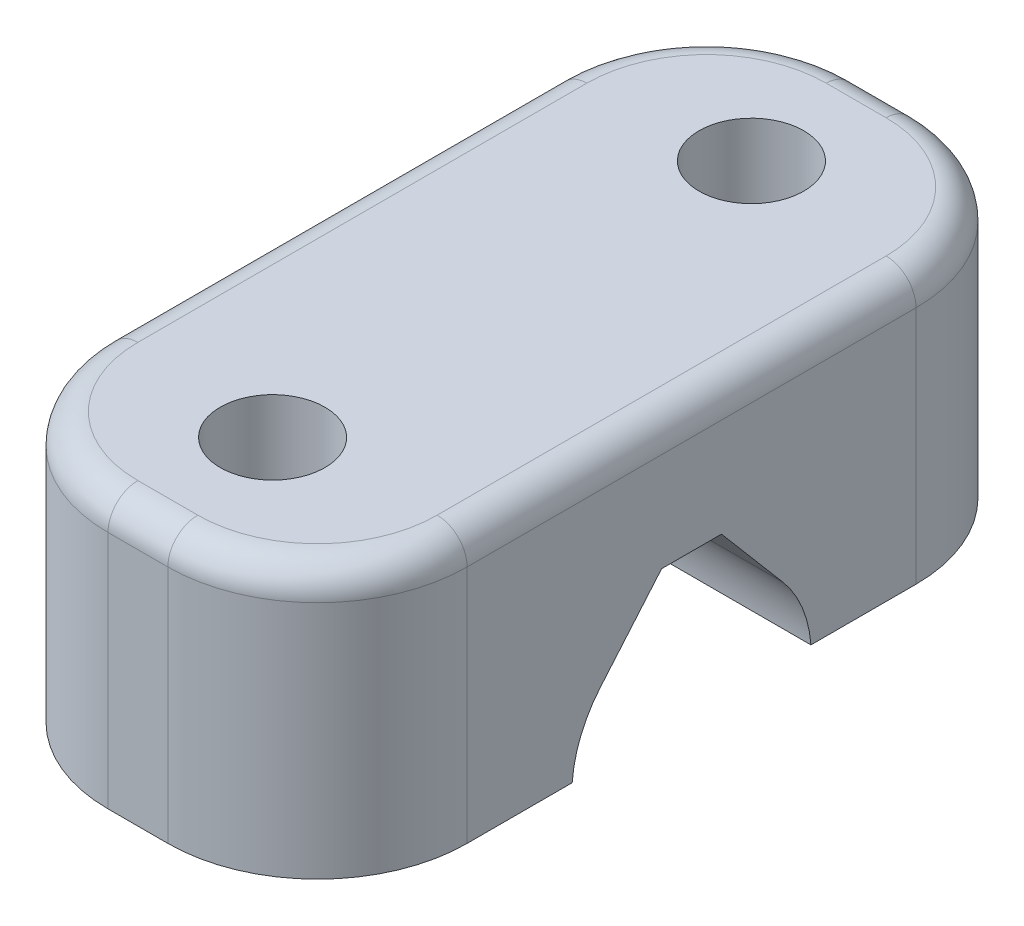
ISO-10303-21;
HEADER;
FILE_DESCRIPTION(('STEP AP214'),'2;1');
FILE_NAME('part.step','',(''),(''),'','','');
FILE_SCHEMA(('AUTOMOTIVE_DESIGN { 1 0 10303 214 1 1 1 1 }'));
ENDSEC;
DATA;
#1=APPLICATION_CONTEXT('core data for automotive mechanical design processes');
#2=APPLICATION_PROTOCOL_DEFINITION('international standard','automotive_design',2000,#1);
#3=PRODUCT_CONTEXT('',#1,'mechanical');
#4=PRODUCT('Part','Part','',(#3));
#5=PRODUCT_RELATED_PRODUCT_CATEGORY('part','',(#4));
#6=PRODUCT_DEFINITION_FORMATION('','',#4);
#7=PRODUCT_DEFINITION_CONTEXT('part definition',#1,'design');
#8=PRODUCT_DEFINITION('design','',#6,#7);
#9=PRODUCT_DEFINITION_SHAPE('','',#8);
#10=(LENGTH_UNIT() NAMED_UNIT(*) SI_UNIT(.MILLI.,.METRE.));
#11=(NAMED_UNIT(*) PLANE_ANGLE_UNIT() SI_UNIT($,.RADIAN.));
#12=(NAMED_UNIT(*) SI_UNIT($,.STERADIAN.) SOLID_ANGLE_UNIT());
#13=UNCERTAINTY_MEASURE_WITH_UNIT(LENGTH_MEASURE(1.E-05),#10,'distance_accuracy_value','');
#14=(GEOMETRIC_REPRESENTATION_CONTEXT(3) GLOBAL_UNCERTAINTY_ASSIGNED_CONTEXT((#13)) GLOBAL_UNIT_ASSIGNED_CONTEXT((#10,
#11,#12)) REPRESENTATION_CONTEXT('',''));
#15=CARTESIAN_POINT('',(0.,0.,0.));
#16=DIRECTION('',(0.,0.,1.));
#17=DIRECTION('',(1.,0.,0.));
#18=AXIS2_PLACEMENT_3D('',#15,#16,#17);
#19=CARTESIAN_POINT('',(0.,9.,-12.5));
#20=DIRECTION('',(1.,0.,0.));
#21=DIRECTION('',(0.,0.,-1.));
#22=AXIS2_PLACEMENT_3D('',#19,#20,#21);
#23=PLANE('',#22);
#24=DIRECTION('',(0.,-1.,0.));
#25=VECTOR('',#24,1.);
#26=CARTESIAN_POINT('',(0.,9.,7.5));
#27=LINE('',#26,#25);
#28=CARTESIAN_POINT('',(0.,0.,7.5));
#29=VERTEX_POINT('',#28);
#30=CARTESIAN_POINT('',(0.,8.,7.5));
#31=VERTEX_POINT('',#30);
#32=EDGE_CURVE('E224',#29,#31,#27,.F.);
#33=ORIENTED_EDGE('',*,*,#32,.T.);
#34=DIRECTION('',(0.,0.,1.));
#35=VECTOR('',#34,1.);
#36=CARTESIAN_POINT('',(0.,8.,-7.5));
#37=LINE('',#36,#35);
#38=CARTESIAN_POINT('',(0.,8.,-7.5));
#39=VERTEX_POINT('',#38);
#40=EDGE_CURVE('E274',#31,#39,#37,.F.);
#41=ORIENTED_EDGE('',*,*,#40,.T.);
#42=DIRECTION('',(0.,-1.,0.));
#43=VECTOR('',#42,1.);
#44=CARTESIAN_POINT('',(0.,9.,-7.5));
#45=LINE('',#44,#43);
#46=CARTESIAN_POINT('',(0.,0.,-7.5));
#47=VERTEX_POINT('',#46);
#48=EDGE_CURVE('E227',#39,#47,#45,.T.);
#49=ORIENTED_EDGE('',*,*,#48,.T.);
#50=DIRECTION('',(0.,0.,1.));
#51=VECTOR('',#50,1.);
#52=CARTESIAN_POINT('',(0.,0.,-12.5));
#53=LINE('',#52,#51);
#54=CARTESIAN_POINT('',(0.,0.,-3.98873413503583));
#55=VERTEX_POINT('',#54);
#56=EDGE_CURVE('E210',#47,#55,#53,.T.);
#57=ORIENTED_EDGE('',*,*,#56,.T.);
#58=CARTESIAN_POINT('',(0.,-0.3,0.));
#59=DIRECTION('',(1.,0.,0.));
#60=DIRECTION('',(0.,0.,-1.));
#61=AXIS2_PLACEMENT_3D('',#58,#59,#60);
#62=CIRCLE('',#61,4.);
#63=CARTESIAN_POINT('',(0.,2.29041882151256,-3.04790589243722));
#64=VERTEX_POINT('',#63);
#65=EDGE_CURVE('E199',#55,#64,#62,.T.);
#66=ORIENTED_EDGE('',*,*,#65,.T.);
#67=DIRECTION('',(0.,0.761976473109303,0.647604705378139));
#68=VECTOR('',#67,1.);
#69=CARTESIAN_POINT('',(0.,4.7,-1.));
#70=LINE('',#69,#68);
#71=CARTESIAN_POINT('',(0.,4.7,-1.));
#72=VERTEX_POINT('',#71);
#73=EDGE_CURVE('E180',#64,#72,#70,.T.);
#74=ORIENTED_EDGE('',*,*,#73,.T.);
#75=DIRECTION('',(0.,0.,1.));
#76=VECTOR('',#75,1.);
#77=CARTESIAN_POINT('',(0.,4.7,0.999999999999999));
#78=LINE('',#77,#76);
#79=CARTESIAN_POINT('',(0.,4.7,0.999999999999999));
#80=VERTEX_POINT('',#79);
#81=EDGE_CURVE('E201',#72,#80,#78,.T.);
#82=ORIENTED_EDGE('',*,*,#81,.T.);
#83=DIRECTION('',(0.,-0.761976473109304,0.647604705378139));
#84=VECTOR('',#83,1.);
#85=CARTESIAN_POINT('',(0.,2.29041882151256,3.04790589243721));
#86=LINE('',#85,#84);
#87=CARTESIAN_POINT('',(0.,2.29041882151256,3.04790589243721));
#88=VERTEX_POINT('',#87);
#89=EDGE_CURVE('E173',#80,#88,#86,.T.);
#90=ORIENTED_EDGE('',*,*,#89,.T.);
#91=CARTESIAN_POINT('',(0.,0.,3.98873413503583));
#92=VERTEX_POINT('',#91);
#93=EDGE_CURVE('E196',#88,#92,#62,.T.);
#94=ORIENTED_EDGE('',*,*,#93,.T.);
#95=EDGE_CURVE('E181',#92,#29,#53,.T.);
#96=ORIENTED_EDGE('',*,*,#95,.T.);
#97=EDGE_LOOP('',(#33,#41,#49,#57,#66,#74,#82,#90,#94,#96));
#98=FACE_BOUND('',#97,.T.);
#99=ADVANCED_FACE('F33',(#98),#23,.F.);
#100=CARTESIAN_POINT('',(12.,9.,-12.5));
#101=DIRECTION('',(-1.,0.,0.));
#102=DIRECTION('',(0.,0.,1.));
#103=AXIS2_PLACEMENT_3D('',#100,#101,#102);
#104=PLANE('',#103);
#105=DIRECTION('',(0.,-1.,0.));
#106=VECTOR('',#105,1.);
#107=CARTESIAN_POINT('',(12.,9.,-7.5));
#108=LINE('',#107,#106);
#109=CARTESIAN_POINT('',(12.,0.,-7.5));
#110=VERTEX_POINT('',#109);
#111=CARTESIAN_POINT('',(12.,8.,-7.5));
#112=VERTEX_POINT('',#111);
#113=EDGE_CURVE('E239',#110,#112,#108,.F.);
#114=ORIENTED_EDGE('',*,*,#113,.T.);
#115=DIRECTION('',(0.,0.,-1.));
#116=VECTOR('',#115,1.);
#117=CARTESIAN_POINT('',(12.,8.,7.5));
#118=LINE('',#117,#116);
#119=CARTESIAN_POINT('',(12.,8.,7.5));
#120=VERTEX_POINT('',#119);
#121=EDGE_CURVE('E11',#112,#120,#118,.F.);
#122=ORIENTED_EDGE('',*,*,#121,.T.);
#123=DIRECTION('',(0.,-1.,0.));
#124=VECTOR('',#123,1.);
#125=CARTESIAN_POINT('',(12.,9.,7.5));
#126=LINE('',#125,#124);
#127=CARTESIAN_POINT('',(12.,0.,7.5));
#128=VERTEX_POINT('',#127);
#129=EDGE_CURVE('E237',#120,#128,#126,.T.);
#130=ORIENTED_EDGE('',*,*,#129,.T.);
#131=DIRECTION('',(0.,0.,-1.));
#132=VECTOR('',#131,1.);
#133=CARTESIAN_POINT('',(12.,0.,-12.5));
#134=LINE('',#133,#132);
#135=CARTESIAN_POINT('',(12.,0.,3.98873413503583));
#136=VERTEX_POINT('',#135);
#137=EDGE_CURVE('E216',#128,#136,#134,.T.);
#138=ORIENTED_EDGE('',*,*,#137,.T.);
#139=CARTESIAN_POINT('',(12.,-0.3,0.));
#140=DIRECTION('',(1.,0.,0.));
#141=DIRECTION('',(0.,0.,-1.));
#142=AXIS2_PLACEMENT_3D('',#139,#140,#141);
#143=CIRCLE('',#142,4.);
#144=CARTESIAN_POINT('',(12.,2.29041882151256,3.04790589243721));
#145=VERTEX_POINT('',#144);
#146=EDGE_CURVE('E172',#145,#136,#143,.T.);
#147=ORIENTED_EDGE('',*,*,#146,.F.);
#148=DIRECTION('',(0.,-0.761976473109304,0.647604705378139));
#149=VECTOR('',#148,1.);
#150=CARTESIAN_POINT('',(12.,2.29041882151256,3.04790589243721));
#151=LINE('',#150,#149);
#152=CARTESIAN_POINT('',(12.,4.7,0.999999999999999));
#153=VERTEX_POINT('',#152);
#154=EDGE_CURVE('E189',#153,#145,#151,.T.);
#155=ORIENTED_EDGE('',*,*,#154,.F.);
#156=DIRECTION('',(0.,0.,1.));
#157=VECTOR('',#156,1.);
#158=CARTESIAN_POINT('',(12.,4.7,0.999999999999999));
#159=LINE('',#158,#157);
#160=CARTESIAN_POINT('',(12.,4.7,-1.));
#161=VERTEX_POINT('',#160);
#162=EDGE_CURVE('E187',#161,#153,#159,.T.);
#163=ORIENTED_EDGE('',*,*,#162,.F.);
#164=DIRECTION('',(0.,0.761976473109303,0.647604705378139));
#165=VECTOR('',#164,1.);
#166=CARTESIAN_POINT('',(12.,4.7,-1.));
#167=LINE('',#166,#165);
#168=CARTESIAN_POINT('',(12.,2.29041882151256,-3.04790589243722));
#169=VERTEX_POINT('',#168);
#170=EDGE_CURVE('E177',#169,#161,#167,.T.);
#171=ORIENTED_EDGE('',*,*,#170,.F.);
#172=CARTESIAN_POINT('',(12.,0.,-3.98873413503583));
#173=VERTEX_POINT('',#172);
#174=EDGE_CURVE('E160',#173,#169,#143,.T.);
#175=ORIENTED_EDGE('',*,*,#174,.F.);
#176=EDGE_CURVE('E215',#173,#110,#134,.T.);
#177=ORIENTED_EDGE('',*,*,#176,.T.);
#178=EDGE_LOOP('',(#114,#122,#130,#138,#147,#155,#163,#171,#175,#177));
#179=FACE_BOUND('',#178,.T.);
#180=ADVANCED_FACE('F185',(#179),#104,.F.);
#181=CARTESIAN_POINT('',(0.,0.,0.));
#182=DIRECTION('',(0.,1.,0.));
#183=DIRECTION('',(0.,0.,1.));
#184=AXIS2_PLACEMENT_3D('',#181,#182,#183);
#185=PLANE('',#184);
#186=CARTESIAN_POINT('',(6.,0.,-8.));
#187=DIRECTION('',(0.,-1.,0.));
#188=DIRECTION('',(0.,0.,-1.));
#189=AXIS2_PLACEMENT_3D('',#186,#187,#188);
#190=CIRCLE('',#189,1.75);
#191=CARTESIAN_POINT('',(6.,0.,-9.75));
#192=VERTEX_POINT('',#191);
#193=EDGE_CURVE('E301',#192,#192,#190,.T.);
#194=ORIENTED_EDGE('',*,*,#193,.F.);
#195=EDGE_LOOP('',(#194));
#196=FACE_BOUND('',#195,.T.);
#197=ORIENTED_EDGE('',*,*,#56,.F.);
#198=CARTESIAN_POINT('',(5.,0.,-7.5));
#199=DIRECTION('',(0.,1.,0.));
#200=DIRECTION('',(0.,0.,1.));
#201=AXIS2_PLACEMENT_3D('',#198,#199,#200);
#202=CIRCLE('',#201,5.);
#203=CARTESIAN_POINT('',(5.,0.,-12.5));
#204=VERTEX_POINT('',#203);
#205=EDGE_CURVE('E231',#47,#204,#202,.F.);
#206=ORIENTED_EDGE('',*,*,#205,.T.);
#207=DIRECTION('',(-1.,0.,0.));
#208=VECTOR('',#207,1.);
#209=CARTESIAN_POINT('',(0.,0.,-12.5));
#210=LINE('',#209,#208);
#211=CARTESIAN_POINT('',(7.,0.,-12.5));
#212=VERTEX_POINT('',#211);
#213=EDGE_CURVE('E218',#212,#204,#210,.T.);
#214=ORIENTED_EDGE('',*,*,#213,.F.);
#215=CARTESIAN_POINT('',(7.,0.,-7.5));
#216=DIRECTION('',(0.,1.,0.));
#217=DIRECTION('',(0.,0.,1.));
#218=AXIS2_PLACEMENT_3D('',#215,#216,#217);
#219=CIRCLE('',#218,5.);
#220=EDGE_CURVE('E229',#212,#110,#219,.F.);
#221=ORIENTED_EDGE('',*,*,#220,.T.);
#222=ORIENTED_EDGE('',*,*,#176,.F.);
#223=DIRECTION('',(-1.,0.,0.));
#224=VECTOR('',#223,1.);
#225=CARTESIAN_POINT('',(12.,0.,-3.98873413503583));
#226=LINE('',#225,#224);
#227=EDGE_CURVE('E167',#55,#173,#226,.F.);
#228=ORIENTED_EDGE('',*,*,#227,.F.);
#229=EDGE_LOOP('',(#197,#206,#214,#221,#222,#228));
#230=FACE_BOUND('',#229,.T.);
#231=ADVANCED_FACE('F326',(#196,#230),#185,.F.);
#232=CARTESIAN_POINT('',(6.,0.,8.));
#233=DIRECTION('',(0.,-1.,0.));
#234=DIRECTION('',(0.,0.,-1.));
#235=AXIS2_PLACEMENT_3D('',#232,#233,#234);
#236=CIRCLE('',#235,1.75);
#237=CARTESIAN_POINT('',(6.,0.,6.25));
#238=VERTEX_POINT('',#237);
#239=EDGE_CURVE('E312',#238,#238,#236,.T.);
#240=ORIENTED_EDGE('',*,*,#239,.F.);
#241=EDGE_LOOP('',(#240));
#242=FACE_BOUND('',#241,.T.);
#243=ORIENTED_EDGE('',*,*,#137,.F.);
#244=CARTESIAN_POINT('',(7.,0.,7.5));
#245=DIRECTION('',(0.,1.,0.));
#246=DIRECTION('',(0.,0.,1.));
#247=AXIS2_PLACEMENT_3D('',#244,#245,#246);
#248=CIRCLE('',#247,5.);
#249=CARTESIAN_POINT('',(7.,0.,12.5));
#250=VERTEX_POINT('',#249);
#251=EDGE_CURVE('E243',#128,#250,#248,.F.);
#252=ORIENTED_EDGE('',*,*,#251,.T.);
#253=DIRECTION('',(1.,0.,0.));
#254=VECTOR('',#253,1.);
#255=CARTESIAN_POINT('',(0.,0.,12.5));
#256=LINE('',#255,#254);
#257=CARTESIAN_POINT('',(5.,0.,12.5));
#258=VERTEX_POINT('',#257);
#259=EDGE_CURVE('E212',#258,#250,#256,.T.);
#260=ORIENTED_EDGE('',*,*,#259,.F.);
#261=CARTESIAN_POINT('',(5.,0.,7.5));
#262=DIRECTION('',(0.,1.,0.));
#263=DIRECTION('',(0.,0.,1.));
#264=AXIS2_PLACEMENT_3D('',#261,#262,#263);
#265=CIRCLE('',#264,5.);
#266=EDGE_CURVE('E241',#258,#29,#265,.F.);
#267=ORIENTED_EDGE('',*,*,#266,.T.);
#268=ORIENTED_EDGE('',*,*,#95,.F.);
#269=DIRECTION('',(-1.,0.,0.));
#270=VECTOR('',#269,1.);
#271=CARTESIAN_POINT('',(12.,0.,3.98873413503583));
#272=LINE('',#271,#270);
#273=EDGE_CURVE('E221',#136,#92,#272,.T.);
#274=ORIENTED_EDGE('',*,*,#273,.F.);
#275=EDGE_LOOP('',(#243,#252,#260,#267,#268,#274));
#276=FACE_BOUND('',#275,.T.);
#277=ADVANCED_FACE('F322',(#242,#276),#185,.F.);
#278=CARTESIAN_POINT('',(0.,9.,12.5));
#279=DIRECTION('',(0.,0.,-1.));
#280=DIRECTION('',(-1.,0.,0.));
#281=AXIS2_PLACEMENT_3D('',#278,#279,#280);
#282=PLANE('',#281);
#283=DIRECTION('',(0.,-1.,0.));
#284=VECTOR('',#283,1.);
#285=CARTESIAN_POINT('',(7.,9.,12.5));
#286=LINE('',#285,#284);
#287=CARTESIAN_POINT('',(7.,8.,12.5));
#288=VERTEX_POINT('',#287);
#289=EDGE_CURVE('E247',#250,#288,#286,.F.);
#290=ORIENTED_EDGE('',*,*,#289,.T.);
#291=DIRECTION('',(1.,0.,0.));
#292=VECTOR('',#291,1.);
#293=CARTESIAN_POINT('',(5.,8.,12.5));
#294=LINE('',#293,#292);
#295=CARTESIAN_POINT('',(5.,8.,12.5));
#296=VERTEX_POINT('',#295);
#297=EDGE_CURVE('E270',#288,#296,#294,.F.);
#298=ORIENTED_EDGE('',*,*,#297,.T.);
#299=DIRECTION('',(0.,-1.,0.));
#300=VECTOR('',#299,1.);
#301=CARTESIAN_POINT('',(5.,9.,12.5));
#302=LINE('',#301,#300);
#303=EDGE_CURVE('E245',#296,#258,#302,.T.);
#304=ORIENTED_EDGE('',*,*,#303,.T.);
#305=ORIENTED_EDGE('',*,*,#259,.T.);
#306=EDGE_LOOP('',(#290,#298,#304,#305));
#307=FACE_BOUND('',#306,.T.);
#308=ADVANCED_FACE('F325',(#307),#282,.F.);
#309=CARTESIAN_POINT('',(0.,9.,-12.5));
#310=DIRECTION('',(0.,0.,1.));
#311=DIRECTION('',(1.,0.,0.));
#312=AXIS2_PLACEMENT_3D('',#309,#310,#311);
#313=PLANE('',#312);
#314=DIRECTION('',(0.,-1.,0.));
#315=VECTOR('',#314,1.);
#316=CARTESIAN_POINT('',(5.,9.,-12.5));
#317=LINE('',#316,#315);
#318=CARTESIAN_POINT('',(5.,8.,-12.5));
#319=VERTEX_POINT('',#318);
#320=EDGE_CURVE('E235',#204,#319,#317,.F.);
#321=ORIENTED_EDGE('',*,*,#320,.T.);
#322=DIRECTION('',(-1.,0.,0.));
#323=VECTOR('',#322,1.);
#324=CARTESIAN_POINT('',(7.,8.,-12.5));
#325=LINE('',#324,#323);
#326=CARTESIAN_POINT('',(7.,8.,-12.5));
#327=VERTEX_POINT('',#326);
#328=EDGE_CURVE('E57',#319,#327,#325,.F.);
#329=ORIENTED_EDGE('',*,*,#328,.T.);
#330=DIRECTION('',(0.,-1.,0.));
#331=VECTOR('',#330,1.);
#332=CARTESIAN_POINT('',(7.,9.,-12.5));
#333=LINE('',#332,#331);
#334=EDGE_CURVE('E233',#327,#212,#333,.T.);
#335=ORIENTED_EDGE('',*,*,#334,.T.);
#336=ORIENTED_EDGE('',*,*,#213,.T.);
#337=EDGE_LOOP('',(#321,#329,#335,#336));
#338=FACE_BOUND('',#337,.T.);
#339=ADVANCED_FACE('F356',(#338),#313,.F.);
#340=CARTESIAN_POINT('',(0.,9.,0.));
#341=DIRECTION('',(0.,1.,0.));
#342=DIRECTION('',(0.,0.,1.));
#343=AXIS2_PLACEMENT_3D('',#340,#341,#342);
#344=PLANE('',#343);
#345=DIRECTION('',(1.,0.,0.));
#346=VECTOR('',#345,1.);
#347=CARTESIAN_POINT('',(7.,9.,11.5));
#348=LINE('',#347,#346);
#349=CARTESIAN_POINT('',(5.,9.,11.5));
#350=VERTEX_POINT('',#349);
#351=CARTESIAN_POINT('',(7.,9.,11.5));
#352=VERTEX_POINT('',#351);
#353=EDGE_CURVE('E262',#350,#352,#348,.T.);
#354=ORIENTED_EDGE('',*,*,#353,.T.);
#355=CARTESIAN_POINT('',(7.,9.,7.5));
#356=DIRECTION('',(0.,1.,0.));
#357=DIRECTION('',(0.,0.,1.));
#358=AXIS2_PLACEMENT_3D('',#355,#356,#357);
#359=CIRCLE('',#358,4.);
#360=CARTESIAN_POINT('',(11.,9.,7.5));
#361=VERTEX_POINT('',#360);
#362=EDGE_CURVE('E264',#352,#361,#359,.T.);
#363=ORIENTED_EDGE('',*,*,#362,.T.);
#364=DIRECTION('',(0.,0.,-1.));
#365=VECTOR('',#364,1.);
#366=CARTESIAN_POINT('',(11.,9.,-7.5));
#367=LINE('',#366,#365);
#368=CARTESIAN_POINT('',(11.,9.,-7.5));
#369=VERTEX_POINT('',#368);
#370=EDGE_CURVE('E250',#361,#369,#367,.T.);
#371=ORIENTED_EDGE('',*,*,#370,.T.);
#372=CARTESIAN_POINT('',(7.,9.,-7.5));
#373=DIRECTION('',(0.,1.,0.));
#374=DIRECTION('',(0.,0.,1.));
#375=AXIS2_PLACEMENT_3D('',#372,#373,#374);
#376=CIRCLE('',#375,4.);
#377=CARTESIAN_POINT('',(7.,9.,-11.5));
#378=VERTEX_POINT('',#377);
#379=EDGE_CURVE('E252',#369,#378,#376,.T.);
#380=ORIENTED_EDGE('',*,*,#379,.T.);
#381=DIRECTION('',(-1.,0.,0.));
#382=VECTOR('',#381,1.);
#383=CARTESIAN_POINT('',(5.,9.,-11.5));
#384=LINE('',#383,#382);
#385=CARTESIAN_POINT('',(5.,9.,-11.5));
#386=VERTEX_POINT('',#385);
#387=EDGE_CURVE('E254',#378,#386,#384,.T.);
#388=ORIENTED_EDGE('',*,*,#387,.T.);
#389=CARTESIAN_POINT('',(5.,9.,-7.5));
#390=DIRECTION('',(0.,1.,0.));
#391=DIRECTION('',(0.,0.,1.));
#392=AXIS2_PLACEMENT_3D('',#389,#390,#391);
#393=CIRCLE('',#392,4.);
#394=CARTESIAN_POINT('',(1.,9.,-7.5));
#395=VERTEX_POINT('',#394);
#396=EDGE_CURVE('E256',#386,#395,#393,.T.);
#397=ORIENTED_EDGE('',*,*,#396,.T.);
#398=DIRECTION('',(0.,0.,1.));
#399=VECTOR('',#398,1.);
#400=CARTESIAN_POINT('',(1.,9.,7.5));
#401=LINE('',#400,#399);
#402=CARTESIAN_POINT('',(1.,9.,7.5));
#403=VERTEX_POINT('',#402);
#404=EDGE_CURVE('E258',#395,#403,#401,.T.);
#405=ORIENTED_EDGE('',*,*,#404,.T.);
#406=CARTESIAN_POINT('',(5.,9.,7.5));
#407=DIRECTION('',(0.,1.,0.));
#408=DIRECTION('',(0.,0.,1.));
#409=AXIS2_PLACEMENT_3D('',#406,#407,#408);
#410=CIRCLE('',#409,4.);
#411=EDGE_CURVE('E260',#403,#350,#410,.T.);
#412=ORIENTED_EDGE('',*,*,#411,.T.);
#413=EDGE_LOOP('',(#354,#363,#371,#380,#388,#397,#405,#412));
#414=FACE_BOUND('',#413,.T.);
#415=CARTESIAN_POINT('',(6.,9.,-8.));
#416=DIRECTION('',(0.,-1.,0.));
#417=DIRECTION('',(0.,0.,-1.));
#418=AXIS2_PLACEMENT_3D('',#415,#416,#417);
#419=CIRCLE('',#418,1.75);
#420=CARTESIAN_POINT('',(6.,9.,-9.75));
#421=VERTEX_POINT('',#420);
#422=EDGE_CURVE('E307',#421,#421,#419,.T.);
#423=ORIENTED_EDGE('',*,*,#422,.T.);
#424=EDGE_LOOP('',(#423));
#425=FACE_BOUND('',#424,.T.);
#426=CARTESIAN_POINT('',(6.,9.,8.));
#427=DIRECTION('',(0.,-1.,0.));
#428=DIRECTION('',(0.,0.,-1.));
#429=AXIS2_PLACEMENT_3D('',#426,#427,#428);
#430=CIRCLE('',#429,1.75);
#431=CARTESIAN_POINT('',(6.,9.,6.25));
#432=VERTEX_POINT('',#431);
#433=EDGE_CURVE('E315',#432,#432,#430,.T.);
#434=ORIENTED_EDGE('',*,*,#433,.T.);
#435=EDGE_LOOP('',(#434));
#436=FACE_BOUND('',#435,.T.);
#437=ADVANCED_FACE('F399',(#414,#425,#436),#344,.T.);
#438=CARTESIAN_POINT('',(12.,-0.3,0.));
#439=DIRECTION('',(-1.,0.,0.));
#440=DIRECTION('',(0.,0.,1.));
#441=AXIS2_PLACEMENT_3D('',#438,#439,#440);
#442=CYLINDRICAL_SURFACE('',#441,4.);
#443=ORIENTED_EDGE('',*,*,#227,.T.);
#444=ORIENTED_EDGE('',*,*,#174,.T.);
#445=DIRECTION('',(-1.,0.,0.));
#446=VECTOR('',#445,1.);
#447=CARTESIAN_POINT('',(12.,2.29041882151256,-3.04790589243722));
#448=LINE('',#447,#446);
#449=EDGE_CURVE('E164',#169,#64,#448,.T.);
#450=ORIENTED_EDGE('',*,*,#449,.T.);
#451=ORIENTED_EDGE('',*,*,#65,.F.);
#452=EDGE_LOOP('',(#443,#444,#450,#451));
#453=FACE_BOUND('',#452,.T.);
#454=ADVANCED_FACE('F162',(#453),#442,.F.);
#455=ORIENTED_EDGE('',*,*,#273,.T.);
#456=ORIENTED_EDGE('',*,*,#93,.F.);
#457=DIRECTION('',(-1.,0.,0.));
#458=VECTOR('',#457,1.);
#459=CARTESIAN_POINT('',(12.,2.29041882151256,3.04790589243721));
#460=LINE('',#459,#458);
#461=EDGE_CURVE('E195',#145,#88,#460,.T.);
#462=ORIENTED_EDGE('',*,*,#461,.F.);
#463=ORIENTED_EDGE('',*,*,#146,.T.);
#464=EDGE_LOOP('',(#455,#456,#462,#463));
#465=FACE_BOUND('',#464,.T.);
#466=ADVANCED_FACE('F337',(#465),#442,.F.);
#467=CARTESIAN_POINT('',(12.,4.7,-1.));
#468=DIRECTION('',(0.,-0.647604705378139,0.761976473109303));
#469=DIRECTION('',(0.,-0.761976473109304,-0.647604705378139));
#470=AXIS2_PLACEMENT_3D('',#467,#468,#469);
#471=PLANE('',#470);
#472=ORIENTED_EDGE('',*,*,#73,.F.);
#473=ORIENTED_EDGE('',*,*,#449,.F.);
#474=ORIENTED_EDGE('',*,*,#170,.T.);
#475=DIRECTION('',(-1.,0.,0.));
#476=VECTOR('',#475,1.);
#477=CARTESIAN_POINT('',(12.,4.7,-1.));
#478=LINE('',#477,#476);
#479=EDGE_CURVE('E182',#161,#72,#478,.T.);
#480=ORIENTED_EDGE('',*,*,#479,.T.);
#481=EDGE_LOOP('',(#472,#473,#474,#480));
#482=FACE_BOUND('',#481,.T.);
#483=ADVANCED_FACE('F176',(#482),#471,.T.);
#484=CARTESIAN_POINT('',(12.,4.7,0.999999999999999));
#485=DIRECTION('',(0.,-1.,0.));
#486=DIRECTION('',(0.,0.,-1.));
#487=AXIS2_PLACEMENT_3D('',#484,#485,#486);
#488=PLANE('',#487);
#489=ORIENTED_EDGE('',*,*,#81,.F.);
#490=ORIENTED_EDGE('',*,*,#479,.F.);
#491=ORIENTED_EDGE('',*,*,#162,.T.);
#492=DIRECTION('',(-1.,0.,0.));
#493=VECTOR('',#492,1.);
#494=CARTESIAN_POINT('',(12.,4.7,0.999999999999999));
#495=LINE('',#494,#493);
#496=EDGE_CURVE('E207',#153,#80,#495,.T.);
#497=ORIENTED_EDGE('',*,*,#496,.T.);
#498=EDGE_LOOP('',(#489,#490,#491,#497));
#499=FACE_BOUND('',#498,.T.);
#500=ADVANCED_FACE('F345',(#499),#488,.T.);
#501=CARTESIAN_POINT('',(12.,2.29041882151256,3.04790589243721));
#502=DIRECTION('',(0.,-0.647604705378139,-0.761976473109304));
#503=DIRECTION('',(0.,0.761976473109304,-0.647604705378139));
#504=AXIS2_PLACEMENT_3D('',#501,#502,#503);
#505=PLANE('',#504);
#506=ORIENTED_EDGE('',*,*,#89,.F.);
#507=ORIENTED_EDGE('',*,*,#496,.F.);
#508=ORIENTED_EDGE('',*,*,#154,.T.);
#509=ORIENTED_EDGE('',*,*,#461,.T.);
#510=EDGE_LOOP('',(#506,#507,#508,#509));
#511=FACE_BOUND('',#510,.T.);
#512=ADVANCED_FACE('F341',(#511),#505,.T.);
#513=CARTESIAN_POINT('',(6.,9.,8.));
#514=DIRECTION('',(0.,-1.,0.));
#515=DIRECTION('',(0.,0.,-1.));
#516=AXIS2_PLACEMENT_3D('',#513,#514,#515);
#517=CYLINDRICAL_SURFACE('',#516,1.75);
#518=ORIENTED_EDGE('',*,*,#433,.F.);
#519=EDGE_LOOP('',(#518));
#520=FACE_BOUND('',#519,.T.);
#521=ORIENTED_EDGE('',*,*,#239,.T.);
#522=EDGE_LOOP('',(#521));
#523=FACE_BOUND('',#522,.T.);
#524=ADVANCED_FACE('F320',(#520,#523),#517,.F.);
#525=CARTESIAN_POINT('',(6.,9.,-8.));
#526=DIRECTION('',(0.,-1.,0.));
#527=DIRECTION('',(0.,0.,-1.));
#528=AXIS2_PLACEMENT_3D('',#525,#526,#527);
#529=CYLINDRICAL_SURFACE('',#528,1.75);
#530=ORIENTED_EDGE('',*,*,#422,.F.);
#531=EDGE_LOOP('',(#530));
#532=FACE_BOUND('',#531,.T.);
#533=ORIENTED_EDGE('',*,*,#193,.T.);
#534=EDGE_LOOP('',(#533));
#535=FACE_BOUND('',#534,.T.);
#536=ADVANCED_FACE('F408',(#532,#535),#529,.F.);
#537=CARTESIAN_POINT('',(5.,9.,-7.5));
#538=DIRECTION('',(0.,-1.,0.));
#539=DIRECTION('',(0.,0.,-1.));
#540=AXIS2_PLACEMENT_3D('',#537,#538,#539);
#541=CYLINDRICAL_SURFACE('',#540,5.);
#542=ORIENTED_EDGE('',*,*,#48,.F.);
#543=CARTESIAN_POINT('',(5.,8.,-7.5));
#544=DIRECTION('',(0.,1.,0.));
#545=DIRECTION('',(0.,0.,1.));
#546=AXIS2_PLACEMENT_3D('',#543,#544,#545);
#547=CIRCLE('',#546,5.);
#548=EDGE_CURVE('E276',#39,#319,#547,.F.);
#549=ORIENTED_EDGE('',*,*,#548,.T.);
#550=ORIENTED_EDGE('',*,*,#320,.F.);
#551=ORIENTED_EDGE('',*,*,#205,.F.);
#552=EDGE_LOOP('',(#542,#549,#550,#551));
#553=FACE_BOUND('',#552,.T.);
#554=ADVANCED_FACE('F359',(#553),#541,.T.);
#555=CARTESIAN_POINT('',(7.,9.,-7.5));
#556=DIRECTION('',(0.,-1.,0.));
#557=DIRECTION('',(0.,0.,-1.));
#558=AXIS2_PLACEMENT_3D('',#555,#556,#557);
#559=CYLINDRICAL_SURFACE('',#558,5.);
#560=ORIENTED_EDGE('',*,*,#334,.F.);
#561=CARTESIAN_POINT('',(7.,8.,-7.5));
#562=DIRECTION('',(0.,1.,0.));
#563=DIRECTION('',(0.,0.,1.));
#564=AXIS2_PLACEMENT_3D('',#561,#562,#563);
#565=CIRCLE('',#564,5.);
#566=EDGE_CURVE('E42',#327,#112,#565,.F.);
#567=ORIENTED_EDGE('',*,*,#566,.T.);
#568=ORIENTED_EDGE('',*,*,#113,.F.);
#569=ORIENTED_EDGE('',*,*,#220,.F.);
#570=EDGE_LOOP('',(#560,#567,#568,#569));
#571=FACE_BOUND('',#570,.T.);
#572=ADVANCED_FACE('F352',(#571),#559,.T.);
#573=CARTESIAN_POINT('',(7.,9.,7.5));
#574=DIRECTION('',(0.,-1.,0.));
#575=DIRECTION('',(0.,0.,-1.));
#576=AXIS2_PLACEMENT_3D('',#573,#574,#575);
#577=CYLINDRICAL_SURFACE('',#576,5.);
#578=ORIENTED_EDGE('',*,*,#129,.F.);
#579=CARTESIAN_POINT('',(7.,8.,7.5));
#580=DIRECTION('',(0.,1.,0.));
#581=DIRECTION('',(0.,0.,1.));
#582=AXIS2_PLACEMENT_3D('',#579,#580,#581);
#583=CIRCLE('',#582,5.);
#584=EDGE_CURVE('E267',#120,#288,#583,.F.);
#585=ORIENTED_EDGE('',*,*,#584,.T.);
#586=ORIENTED_EDGE('',*,*,#289,.F.);
#587=ORIENTED_EDGE('',*,*,#251,.F.);
#588=EDGE_LOOP('',(#578,#585,#586,#587));
#589=FACE_BOUND('',#588,.T.);
#590=ADVANCED_FACE('F374',(#589),#577,.T.);
#591=CARTESIAN_POINT('',(5.,9.,7.5));
#592=DIRECTION('',(0.,-1.,0.));
#593=DIRECTION('',(0.,0.,-1.));
#594=AXIS2_PLACEMENT_3D('',#591,#592,#593);
#595=CYLINDRICAL_SURFACE('',#594,5.);
#596=ORIENTED_EDGE('',*,*,#303,.F.);
#597=CARTESIAN_POINT('',(5.,8.,7.5));
#598=DIRECTION('',(0.,1.,0.));
#599=DIRECTION('',(0.,0.,1.));
#600=AXIS2_PLACEMENT_3D('',#597,#598,#599);
#601=CIRCLE('',#600,5.);
#602=EDGE_CURVE('E272',#296,#31,#601,.F.);
#603=ORIENTED_EDGE('',*,*,#602,.T.);
#604=ORIENTED_EDGE('',*,*,#32,.F.);
#605=ORIENTED_EDGE('',*,*,#266,.F.);
#606=EDGE_LOOP('',(#596,#603,#604,#605));
#607=FACE_BOUND('',#606,.T.);
#608=ADVANCED_FACE('F390',(#607),#595,.T.);
#609=CARTESIAN_POINT('',(5.,8.,-7.5));
#610=DIRECTION('',(0.,1.,0.));
#611=DIRECTION('',(0.,0.,1.));
#612=AXIS2_PLACEMENT_3D('',#609,#610,#611);
#613=TOROIDAL_SURFACE('',#612,4.,1.);
#614=CARTESIAN_POINT('',(5.,8.,-11.5));
#615=DIRECTION('',(1.,0.,0.));
#616=DIRECTION('',(0.,0.,-1.));
#617=AXIS2_PLACEMENT_3D('',#614,#615,#616);
#618=CIRCLE('',#617,1.);
#619=EDGE_CURVE('E295',#319,#386,#618,.T.);
#620=ORIENTED_EDGE('',*,*,#619,.F.);
#621=ORIENTED_EDGE('',*,*,#548,.F.);
#622=CARTESIAN_POINT('',(1.,8.,-7.5));
#623=DIRECTION('',(0.,0.,1.));
#624=DIRECTION('',(1.,0.,0.));
#625=AXIS2_PLACEMENT_3D('',#622,#623,#624);
#626=CIRCLE('',#625,1.);
#627=EDGE_CURVE('E37',#395,#39,#626,.T.);
#628=ORIENTED_EDGE('',*,*,#627,.F.);
#629=ORIENTED_EDGE('',*,*,#396,.F.);
#630=EDGE_LOOP('',(#620,#621,#628,#629));
#631=FACE_BOUND('',#630,.T.);
#632=ADVANCED_FACE('F35',(#631),#613,.T.);
#633=CARTESIAN_POINT('',(1.,8.,0.));
#634=DIRECTION('',(0.,0.,-1.));
#635=DIRECTION('',(-1.,0.,0.));
#636=AXIS2_PLACEMENT_3D('',#633,#634,#635);
#637=CYLINDRICAL_SURFACE('',#636,1.);
#638=ORIENTED_EDGE('',*,*,#627,.T.);
#639=ORIENTED_EDGE('',*,*,#40,.F.);
#640=CARTESIAN_POINT('',(1.,8.,7.5));
#641=DIRECTION('',(0.,0.,1.));
#642=DIRECTION('',(1.,0.,0.));
#643=AXIS2_PLACEMENT_3D('',#640,#641,#642);
#644=CIRCLE('',#643,1.);
#645=EDGE_CURVE('E293',#403,#31,#644,.T.);
#646=ORIENTED_EDGE('',*,*,#645,.F.);
#647=ORIENTED_EDGE('',*,*,#404,.F.);
#648=EDGE_LOOP('',(#638,#639,#646,#647));
#649=FACE_BOUND('',#648,.T.);
#650=ADVANCED_FACE('F396',(#649),#637,.T.);
#651=CARTESIAN_POINT('',(0.,8.,-11.5));
#652=DIRECTION('',(1.,0.,0.));
#653=DIRECTION('',(0.,0.,-1.));
#654=AXIS2_PLACEMENT_3D('',#651,#652,#653);
#655=CYLINDRICAL_SURFACE('',#654,1.);
#656=ORIENTED_EDGE('',*,*,#619,.T.);
#657=ORIENTED_EDGE('',*,*,#387,.F.);
#658=CARTESIAN_POINT('',(7.,8.,-11.5));
#659=DIRECTION('',(1.,0.,0.));
#660=DIRECTION('',(0.,0.,-1.));
#661=AXIS2_PLACEMENT_3D('',#658,#659,#660);
#662=CIRCLE('',#661,1.);
#663=EDGE_CURVE('E290',#327,#378,#662,.T.);
#664=ORIENTED_EDGE('',*,*,#663,.F.);
#665=ORIENTED_EDGE('',*,*,#328,.F.);
#666=EDGE_LOOP('',(#656,#657,#664,#665));
#667=FACE_BOUND('',#666,.T.);
#668=ADVANCED_FACE('F363',(#667),#655,.T.);
#669=CARTESIAN_POINT('',(5.,8.,7.5));
#670=DIRECTION('',(0.,1.,0.));
#671=DIRECTION('',(0.,0.,1.));
#672=AXIS2_PLACEMENT_3D('',#669,#670,#671);
#673=TOROIDAL_SURFACE('',#672,4.,1.);
#674=ORIENTED_EDGE('',*,*,#645,.T.);
#675=ORIENTED_EDGE('',*,*,#602,.F.);
#676=CARTESIAN_POINT('',(5.,8.,11.5));
#677=DIRECTION('',(1.,0.,0.));
#678=DIRECTION('',(0.,0.,-1.));
#679=AXIS2_PLACEMENT_3D('',#676,#677,#678);
#680=CIRCLE('',#679,1.);
#681=EDGE_CURVE('E287',#350,#296,#680,.T.);
#682=ORIENTED_EDGE('',*,*,#681,.F.);
#683=ORIENTED_EDGE('',*,*,#411,.F.);
#684=EDGE_LOOP('',(#674,#675,#682,#683));
#685=FACE_BOUND('',#684,.T.);
#686=ADVANCED_FACE('F393',(#685),#673,.T.);
#687=CARTESIAN_POINT('',(7.,8.,-7.5));
#688=DIRECTION('',(0.,1.,0.));
#689=DIRECTION('',(0.,0.,1.));
#690=AXIS2_PLACEMENT_3D('',#687,#688,#689);
#691=TOROIDAL_SURFACE('',#690,4.,1.);
#692=ORIENTED_EDGE('',*,*,#663,.T.);
#693=ORIENTED_EDGE('',*,*,#379,.F.);
#694=CARTESIAN_POINT('',(11.,8.,-7.5));
#695=DIRECTION('',(0.,0.,1.));
#696=DIRECTION('',(1.,0.,0.));
#697=AXIS2_PLACEMENT_3D('',#694,#695,#696);
#698=CIRCLE('',#697,1.);
#699=EDGE_CURVE('E284',#112,#369,#698,.T.);
#700=ORIENTED_EDGE('',*,*,#699,.F.);
#701=ORIENTED_EDGE('',*,*,#566,.F.);
#702=EDGE_LOOP('',(#692,#693,#700,#701));
#703=FACE_BOUND('',#702,.T.);
#704=ADVANCED_FACE('F366',(#703),#691,.T.);
#705=CARTESIAN_POINT('',(0.,8.,11.5));
#706=DIRECTION('',(-1.,0.,0.));
#707=DIRECTION('',(0.,0.,1.));
#708=AXIS2_PLACEMENT_3D('',#705,#706,#707);
#709=CYLINDRICAL_SURFACE('',#708,1.);
#710=ORIENTED_EDGE('',*,*,#681,.T.);
#711=ORIENTED_EDGE('',*,*,#297,.F.);
#712=CARTESIAN_POINT('',(7.,8.,11.5));
#713=DIRECTION('',(1.,0.,0.));
#714=DIRECTION('',(0.,0.,-1.));
#715=AXIS2_PLACEMENT_3D('',#712,#713,#714);
#716=CIRCLE('',#715,1.);
#717=EDGE_CURVE('E282',#352,#288,#716,.T.);
#718=ORIENTED_EDGE('',*,*,#717,.F.);
#719=ORIENTED_EDGE('',*,*,#353,.F.);
#720=EDGE_LOOP('',(#710,#711,#718,#719));
#721=FACE_BOUND('',#720,.T.);
#722=ADVANCED_FACE('F383',(#721),#709,.T.);
#723=CARTESIAN_POINT('',(11.,8.,0.));
#724=DIRECTION('',(0.,0.,1.));
#725=DIRECTION('',(1.,0.,0.));
#726=AXIS2_PLACEMENT_3D('',#723,#724,#725);
#727=CYLINDRICAL_SURFACE('',#726,1.);
#728=ORIENTED_EDGE('',*,*,#699,.T.);
#729=ORIENTED_EDGE('',*,*,#370,.F.);
#730=CARTESIAN_POINT('',(11.,8.,7.5));
#731=DIRECTION('',(0.,0.,1.));
#732=DIRECTION('',(1.,0.,0.));
#733=AXIS2_PLACEMENT_3D('',#730,#731,#732);
#734=CIRCLE('',#733,1.);
#735=EDGE_CURVE('E280',#120,#361,#734,.T.);
#736=ORIENTED_EDGE('',*,*,#735,.F.);
#737=ORIENTED_EDGE('',*,*,#121,.F.);
#738=EDGE_LOOP('',(#728,#729,#736,#737));
#739=FACE_BOUND('',#738,.T.);
#740=ADVANCED_FACE('F371',(#739),#727,.T.);
#741=CARTESIAN_POINT('',(7.,8.,7.5));
#742=DIRECTION('',(0.,1.,0.));
#743=DIRECTION('',(0.,0.,1.));
#744=AXIS2_PLACEMENT_3D('',#741,#742,#743);
#745=TOROIDAL_SURFACE('',#744,4.,1.);
#746=ORIENTED_EDGE('',*,*,#717,.T.);
#747=ORIENTED_EDGE('',*,*,#584,.F.);
#748=ORIENTED_EDGE('',*,*,#735,.T.);
#749=ORIENTED_EDGE('',*,*,#362,.F.);
#750=EDGE_LOOP('',(#746,#747,#748,#749));
#751=FACE_BOUND('',#750,.T.);
#752=ADVANCED_FACE('F377',(#751),#745,.T.);
#753=CLOSED_SHELL('',(#99,#180,#231,#277,#308,#339,#437,#454,#466,#483,#500,#512,#524,#536,#554,
#572,#590,#608,#632,#650,#668,#686,#704,#722,#740,#752));
#754=MANIFOLD_SOLID_BREP('B2',#753);
#755=ADVANCED_BREP_SHAPE_REPRESENTATION('',(#18,#754),#14);
#756=SHAPE_DEFINITION_REPRESENTATION(#9,#755);
ENDSEC;
END-ISO-10303-21;
